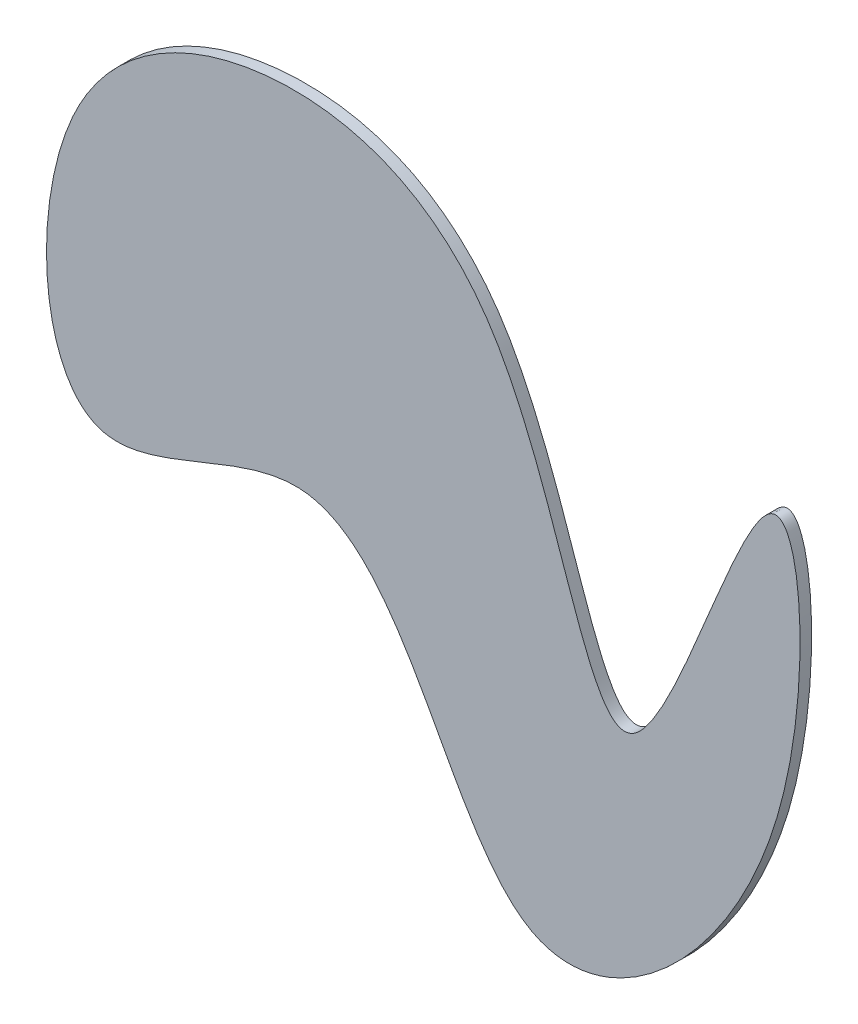
ISO-10303-21;
HEADER;
FILE_DESCRIPTION(('STEP AP214'),'2;1');
FILE_NAME('part.step','',(''),(''),'','','');
FILE_SCHEMA(('AUTOMOTIVE_DESIGN { 1 0 10303 214 1 1 1 1 }'));
ENDSEC;
DATA;
#1=APPLICATION_CONTEXT('core data for automotive mechanical design processes');
#2=APPLICATION_PROTOCOL_DEFINITION('international standard','automotive_design',2000,#1);
#3=PRODUCT_CONTEXT('',#1,'mechanical');
#4=PRODUCT('Part','Part','',(#3));
#5=PRODUCT_RELATED_PRODUCT_CATEGORY('part','',(#4));
#6=PRODUCT_DEFINITION_FORMATION('','',#4);
#7=PRODUCT_DEFINITION_CONTEXT('part definition',#1,'design');
#8=PRODUCT_DEFINITION('design','',#6,#7);
#9=PRODUCT_DEFINITION_SHAPE('','',#8);
#10=(LENGTH_UNIT() NAMED_UNIT(*) SI_UNIT(.MILLI.,.METRE.));
#11=(NAMED_UNIT(*) PLANE_ANGLE_UNIT() SI_UNIT($,.RADIAN.));
#12=(NAMED_UNIT(*) SI_UNIT($,.STERADIAN.) SOLID_ANGLE_UNIT());
#13=UNCERTAINTY_MEASURE_WITH_UNIT(LENGTH_MEASURE(1.E-05),#10,'distance_accuracy_value','');
#14=(GEOMETRIC_REPRESENTATION_CONTEXT(3) GLOBAL_UNCERTAINTY_ASSIGNED_CONTEXT((#13)) GLOBAL_UNIT_ASSIGNED_CONTEXT((#10,
#11,#12)) REPRESENTATION_CONTEXT('',''));
#15=CARTESIAN_POINT('',(0.,0.,0.));
#16=DIRECTION('',(0.,0.,1.));
#17=DIRECTION('',(1.,0.,0.));
#18=AXIS2_PLACEMENT_3D('',#15,#16,#17);
#19=CARTESIAN_POINT('',(-67.678569720435,35.6164026646928,2.54));
#20=CARTESIAN_POINT('',(-76.8114630125233,15.2383722419316,2.54));
#21=CARTESIAN_POINT('',(-74.0209458489873,-42.122886202895,2.54));
#22=CARTESIAN_POINT('',(1.05146762566578,16.0279663761728,2.54));
#23=CARTESIAN_POINT('',(22.3993510596372,-103.494330913206,2.54));
#24=CARTESIAN_POINT('',(97.1470572564177,-34.8427789802804,2.54));
#25=CARTESIAN_POINT('',(89.5849967739864,76.5505224541827,2.54));
#26=CARTESIAN_POINT('',(49.883183620583,-66.9486433921161,2.54));
#27=CARTESIAN_POINT('',(34.9677228769366,51.3565042916708,2.54));
#28=CARTESIAN_POINT('',(-23.5171079738501,72.2282950110184,2.54));
#29=CARTESIAN_POINT('',(-59.0675353914102,54.8300202901524,2.54));
#30=CARTESIAN_POINT('',(-67.678569720435,35.6164026646928,2.54));
#31=B_SPLINE_CURVE_WITH_KNOTS('',3,(#19,#20,#21,#22,#23,#24,#25,#26,#27,#28,#29,#30),
.UNSPECIFIED.,.T.,.F.,(4,1,1,1,1,1,1,1,1,4),(0.,0.10346850912808,0.185363413952311,
0.327107590140166,0.460003495718277,0.563109137860608,0.681009482098512,0.80854462027336,
0.902443743118432,1.),.UNSPECIFIED.);
#32=DIRECTION('',(0.,0.,-1.));
#33=VECTOR('',#32,1.);
#34=SURFACE_OF_LINEAR_EXTRUSION('',#31,#33);
#35=CARTESIAN_POINT('',(-67.678569720435,35.6164026646928,2.54));
#36=VERTEX_POINT('',#35);
#37=EDGE_CURVE('E10',#36,#36,#31,.T.);
#38=ORIENTED_EDGE('',*,*,#37,.F.);
#39=EDGE_LOOP('',(#38));
#40=FACE_BOUND('',#39,.T.);
#41=CARTESIAN_POINT('',(-67.678569720435,35.6164026646928,0.));
#42=CARTESIAN_POINT('',(-76.8114630125233,15.2383722419316,0.));
#43=CARTESIAN_POINT('',(-74.0209458489873,-42.122886202895,0.));
#44=CARTESIAN_POINT('',(1.05146762566578,16.0279663761728,0.));
#45=CARTESIAN_POINT('',(22.3993510596372,-103.494330913206,0.));
#46=CARTESIAN_POINT('',(97.1470572564177,-34.8427789802804,0.));
#47=CARTESIAN_POINT('',(89.5849967739864,76.5505224541827,0.));
#48=CARTESIAN_POINT('',(49.883183620583,-66.9486433921161,0.));
#49=CARTESIAN_POINT('',(34.9677228769366,51.3565042916708,0.));
#50=CARTESIAN_POINT('',(-23.5171079738501,72.2282950110184,0.));
#51=CARTESIAN_POINT('',(-59.0675353914102,54.8300202901524,0.));
#52=CARTESIAN_POINT('',(-67.678569720435,35.6164026646928,0.));
#53=B_SPLINE_CURVE_WITH_KNOTS('',3,(#41,#42,#43,#44,#45,#46,#47,#48,#49,#50,#51,#52),
.UNSPECIFIED.,.T.,.F.,(4,1,1,1,1,1,1,1,1,4),(0.,0.10346850912808,0.185363413952311,
0.327107590140166,0.460003495718277,0.563109137860608,0.681009482098512,0.80854462027336,
0.902443743118432,1.),.UNSPECIFIED.);
#54=CARTESIAN_POINT('',(-67.678569720435,35.6164026646928,0.));
#55=VERTEX_POINT('',#54);
#56=EDGE_CURVE('E43',#55,#55,#53,.T.);
#57=ORIENTED_EDGE('',*,*,#56,.T.);
#58=EDGE_LOOP('',(#57));
#59=FACE_BOUND('',#58,.T.);
#60=ADVANCED_FACE('F39',(#40,#59),#34,.F.);
#61=CARTESIAN_POINT('',(91.4220646126552,11.6356952050918,2.54));
#62=DIRECTION('',(0.,0.,-1.));
#63=DIRECTION('',(-1.,0.,0.));
#64=AXIS2_PLACEMENT_3D('',#61,#62,#63);
#65=PLANE('',#64);
#66=ORIENTED_EDGE('',*,*,#37,.T.);
#67=EDGE_LOOP('',(#66));
#68=FACE_BOUND('',#67,.T.);
#69=ADVANCED_FACE('F62',(#68),#65,.F.);
#70=CARTESIAN_POINT('',(91.4220646126552,11.6356952050918,0.));
#71=DIRECTION('',(0.,0.,-1.));
#72=DIRECTION('',(-1.,0.,0.));
#73=AXIS2_PLACEMENT_3D('',#70,#71,#72);
#74=PLANE('',#73);
#75=ORIENTED_EDGE('',*,*,#56,.F.);
#76=EDGE_LOOP('',(#75));
#77=FACE_BOUND('',#76,.T.);
#78=ADVANCED_FACE('F60',(#77),#74,.T.);
#79=CLOSED_SHELL('',(#60,#69,#78));
#80=MANIFOLD_SOLID_BREP('B2',#79);
#81=ADVANCED_BREP_SHAPE_REPRESENTATION('',(#18,#80),#14);
#82=SHAPE_DEFINITION_REPRESENTATION(#9,#81);
ENDSEC;
END-ISO-10303-21;
